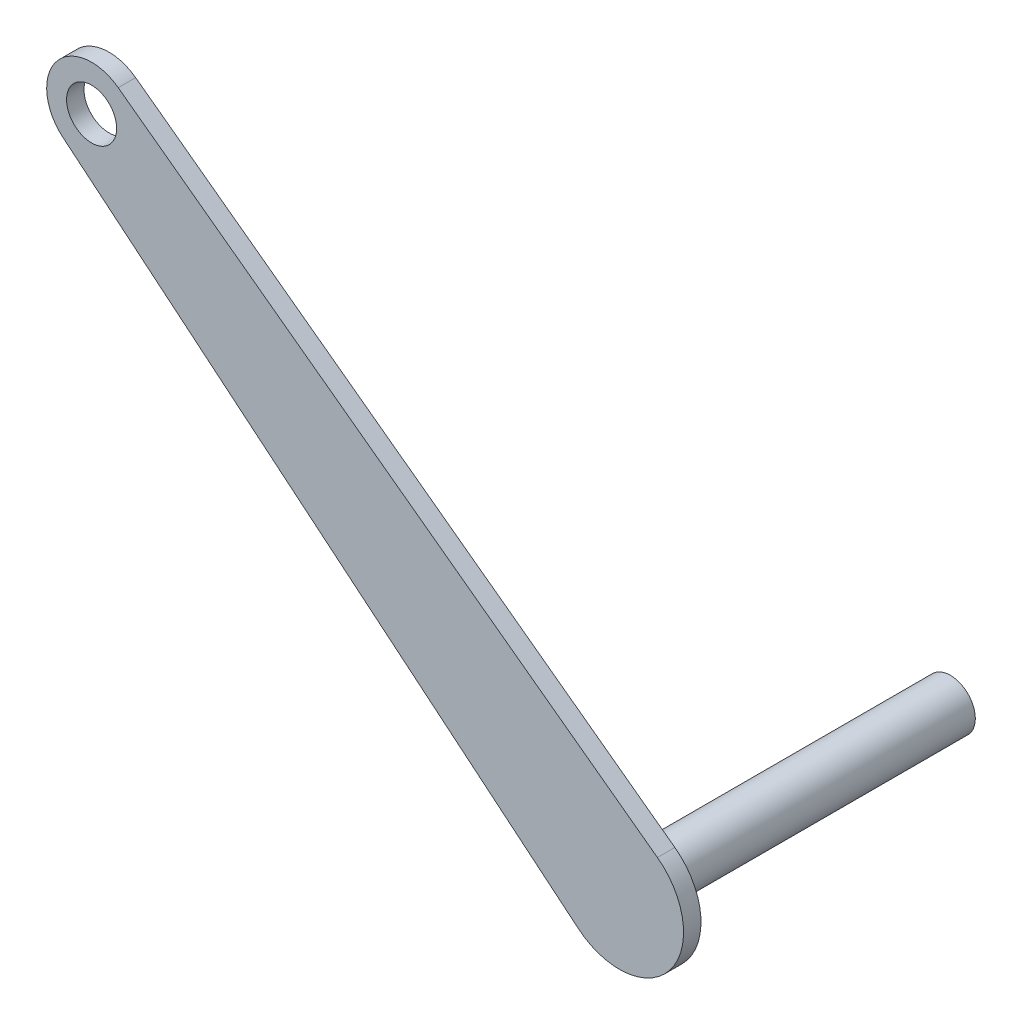
ISO-10303-21;
HEADER;
FILE_DESCRIPTION(('STEP AP214'),'2;1');
FILE_NAME('part.step','',(''),(''),'','','');
FILE_SCHEMA(('AUTOMOTIVE_DESIGN { 1 0 10303 214 1 1 1 1 }'));
ENDSEC;
DATA;
#1=APPLICATION_CONTEXT('core data for automotive mechanical design processes');
#2=APPLICATION_PROTOCOL_DEFINITION('international standard','automotive_design',2000,#1);
#3=PRODUCT_CONTEXT('',#1,'mechanical');
#4=PRODUCT('Part','Part','',(#3));
#5=PRODUCT_RELATED_PRODUCT_CATEGORY('part','',(#4));
#6=PRODUCT_DEFINITION_FORMATION('','',#4);
#7=PRODUCT_DEFINITION_CONTEXT('part definition',#1,'design');
#8=PRODUCT_DEFINITION('design','',#6,#7);
#9=PRODUCT_DEFINITION_SHAPE('','',#8);
#10=(LENGTH_UNIT() NAMED_UNIT(*) SI_UNIT(.MILLI.,.METRE.));
#11=(NAMED_UNIT(*) PLANE_ANGLE_UNIT() SI_UNIT($,.RADIAN.));
#12=(NAMED_UNIT(*) SI_UNIT($,.STERADIAN.) SOLID_ANGLE_UNIT());
#13=UNCERTAINTY_MEASURE_WITH_UNIT(LENGTH_MEASURE(1.E-05),#10,'distance_accuracy_value','');
#14=(GEOMETRIC_REPRESENTATION_CONTEXT(3) GLOBAL_UNCERTAINTY_ASSIGNED_CONTEXT((#13)) GLOBAL_UNIT_ASSIGNED_CONTEXT((#10,
#11,#12)) REPRESENTATION_CONTEXT('',''));
#15=CARTESIAN_POINT('',(0.,0.,0.));
#16=DIRECTION('',(0.,0.,1.));
#17=DIRECTION('',(1.,0.,0.));
#18=AXIS2_PLACEMENT_3D('',#15,#16,#17);
#19=CARTESIAN_POINT('',(-16.5780803786687,54.2991659727017,3.));
#20=DIRECTION('',(0.,0.,1.));
#21=DIRECTION('',(1.,0.,0.));
#22=AXIS2_PLACEMENT_3D('',#19,#20,#21);
#23=PLANE('',#22);
#24=CARTESIAN_POINT('',(-16.5780803786687,54.2991659727017,3.));
#25=DIRECTION('',(0.,0.,1.));
#26=DIRECTION('',(1.,0.,0.));
#27=AXIS2_PLACEMENT_3D('',#24,#25,#26);
#28=CIRCLE('',#27,4.30973614586793);
#29=CARTESIAN_POINT('',(-12.2683442328007,54.2991659727017,3.));
#30=VERTEX_POINT('',#29);
#31=EDGE_CURVE('E98',#30,#30,#28,.T.);
#32=ORIENTED_EDGE('',*,*,#31,.F.);
#33=EDGE_LOOP('',(#32));
#34=FACE_BOUND('',#33,.T.);
#35=CARTESIAN_POINT('',(-16.5780803786687,54.2991659727017,3.));
#36=DIRECTION('',(0.,0.,1.));
#37=DIRECTION('',(1.,0.,0.));
#38=AXIS2_PLACEMENT_3D('',#35,#36,#37);
#39=CIRCLE('',#38,7.73575235674166);
#40=CARTESIAN_POINT('',(-11.9908362627907,60.5280547938461,3.));
#41=VERTEX_POINT('',#40);
#42=CARTESIAN_POINT('',(-21.5162966814582,48.34468158934,3.));
#43=VERTEX_POINT('',#42);
#44=EDGE_CURVE('E109',#41,#43,#39,.T.);
#45=ORIENTED_EDGE('',*,*,#44,.T.);
#46=DIRECTION('',(0.769735651913985,-0.638362770039539,0.));
#47=VECTOR('',#46,1.);
#48=CARTESIAN_POINT('',(-21.5162966814582,48.34468158934,3.));
#49=LINE('',#48,#47);
#50=CARTESIAN_POINT('',(67.2566935657038,-25.2771804329791,3.));
#51=VERTEX_POINT('',#50);
#52=EDGE_CURVE('E93',#43,#51,#49,.T.);
#53=ORIENTED_EDGE('',*,*,#52,.T.);
#54=CARTESIAN_POINT('',(74.3157696242232,-16.765370586239,3.));
#55=DIRECTION('',(0.,0.,1.));
#56=DIRECTION('',(1.,0.,0.));
#57=AXIS2_PLACEMENT_3D('',#54,#55,#56);
#58=CIRCLE('',#57,11.0580948479846);
#59=CARTESIAN_POINT('',(80.8731383435088,-7.8613053828413,3.));
#60=VERTEX_POINT('',#59);
#61=EDGE_CURVE('E59',#51,#60,#58,.T.);
#62=ORIENTED_EDGE('',*,*,#61,.T.);
#63=DIRECTION('',(-0.805207888501749,0.592992627521249,0.));
#64=VECTOR('',#63,1.);
#65=CARTESIAN_POINT('',(80.8731383435088,-7.86130538284129,3.));
#66=LINE('',#65,#64);
#67=EDGE_CURVE('E52',#60,#41,#66,.T.);
#68=ORIENTED_EDGE('',*,*,#67,.T.);
#69=EDGE_LOOP('',(#45,#53,#62,#68));
#70=FACE_BOUND('',#69,.T.);
#71=ADVANCED_FACE('F33',(#34,#70),#23,.T.);
#72=CARTESIAN_POINT('',(-16.5780803786687,54.2991659727017,0.));
#73=DIRECTION('',(0.,0.,1.));
#74=DIRECTION('',(1.,0.,0.));
#75=AXIS2_PLACEMENT_3D('',#72,#73,#74);
#76=PLANE('',#75);
#77=CARTESIAN_POINT('',(-16.5780803786687,54.2991659727017,0.));
#78=DIRECTION('',(0.,0.,1.));
#79=DIRECTION('',(1.,0.,0.));
#80=AXIS2_PLACEMENT_3D('',#77,#78,#79);
#81=CIRCLE('',#80,4.30973614586793);
#82=CARTESIAN_POINT('',(-12.2683442328007,54.2991659727017,0.));
#83=VERTEX_POINT('',#82);
#84=EDGE_CURVE('E102',#83,#83,#81,.T.);
#85=ORIENTED_EDGE('',*,*,#84,.T.);
#86=EDGE_LOOP('',(#85));
#87=FACE_BOUND('',#86,.T.);
#88=CARTESIAN_POINT('',(-16.5780803786687,54.2991659727017,0.));
#89=DIRECTION('',(0.,0.,1.));
#90=DIRECTION('',(1.,0.,0.));
#91=AXIS2_PLACEMENT_3D('',#88,#89,#90);
#92=CIRCLE('',#91,7.73575235674166);
#93=CARTESIAN_POINT('',(-11.9908362627907,60.5280547938461,0.));
#94=VERTEX_POINT('',#93);
#95=CARTESIAN_POINT('',(-21.5162966814582,48.34468158934,0.));
#96=VERTEX_POINT('',#95);
#97=EDGE_CURVE('E85',#94,#96,#92,.T.);
#98=ORIENTED_EDGE('',*,*,#97,.F.);
#99=DIRECTION('',(-0.805207888501749,0.592992627521249,0.));
#100=VECTOR('',#99,1.);
#101=CARTESIAN_POINT('',(80.8731383435088,-7.86130538284129,0.));
#102=LINE('',#101,#100);
#103=CARTESIAN_POINT('',(80.8731383435088,-7.8613053828413,0.));
#104=VERTEX_POINT('',#103);
#105=EDGE_CURVE('E107',#104,#94,#102,.T.);
#106=ORIENTED_EDGE('',*,*,#105,.F.);
#107=CARTESIAN_POINT('',(74.3157696242232,-16.765370586239,0.));
#108=DIRECTION('',(0.,0.,1.));
#109=DIRECTION('',(1.,0.,0.));
#110=AXIS2_PLACEMENT_3D('',#107,#108,#109);
#111=CIRCLE('',#110,11.0580948479846);
#112=CARTESIAN_POINT('',(67.2566935657038,-25.2771804329791,0.));
#113=VERTEX_POINT('',#112);
#114=EDGE_CURVE('E86',#113,#104,#111,.T.);
#115=ORIENTED_EDGE('',*,*,#114,.F.);
#116=DIRECTION('',(0.769735651913985,-0.638362770039539,0.));
#117=VECTOR('',#116,1.);
#118=CARTESIAN_POINT('',(-21.5162966814582,48.34468158934,0.));
#119=LINE('',#118,#117);
#120=EDGE_CURVE('E80',#96,#113,#119,.T.);
#121=ORIENTED_EDGE('',*,*,#120,.F.);
#122=EDGE_LOOP('',(#98,#106,#115,#121));
#123=FACE_BOUND('',#122,.T.);
#124=CARTESIAN_POINT('',(74.3157696242232,-16.765370586239,0.));
#125=DIRECTION('',(0.,0.,1.));
#126=DIRECTION('',(1.,0.,0.));
#127=AXIS2_PLACEMENT_3D('',#124,#125,#126);
#128=CIRCLE('',#127,4.30973614586794);
#129=CARTESIAN_POINT('',(78.6255057700911,-16.765370586239,0.));
#130=VERTEX_POINT('',#129);
#131=EDGE_CURVE('E222',#130,#130,#128,.T.);
#132=ORIENTED_EDGE('',*,*,#131,.T.);
#133=EDGE_LOOP('',(#132));
#134=FACE_BOUND('',#133,.T.);
#135=ADVANCED_FACE('F81',(#87,#123,#134),#76,.F.);
#136=CARTESIAN_POINT('',(-16.5780803786687,54.2991659727017,3.));
#137=DIRECTION('',(0.,0.,-1.));
#138=DIRECTION('',(-1.,0.,0.));
#139=AXIS2_PLACEMENT_3D('',#136,#137,#138);
#140=CYLINDRICAL_SURFACE('',#139,7.73575235674166);
#141=ORIENTED_EDGE('',*,*,#97,.T.);
#142=DIRECTION('',(0.,0.,-1.));
#143=VECTOR('',#142,1.);
#144=CARTESIAN_POINT('',(-21.5162966814582,48.34468158934,3.));
#145=LINE('',#144,#143);
#146=EDGE_CURVE('E11',#43,#96,#145,.T.);
#147=ORIENTED_EDGE('',*,*,#146,.F.);
#148=ORIENTED_EDGE('',*,*,#44,.F.);
#149=DIRECTION('',(0.,0.,-1.));
#150=VECTOR('',#149,1.);
#151=CARTESIAN_POINT('',(-11.9908362627907,60.5280547938461,3.));
#152=LINE('',#151,#150);
#153=EDGE_CURVE('E97',#41,#94,#152,.T.);
#154=ORIENTED_EDGE('',*,*,#153,.T.);
#155=EDGE_LOOP('',(#141,#147,#148,#154));
#156=FACE_BOUND('',#155,.T.);
#157=ADVANCED_FACE('F35',(#156),#140,.T.);
#158=CARTESIAN_POINT('',(-21.5162966814582,48.34468158934,3.));
#159=DIRECTION('',(0.638362770039539,0.769735651913985,0.));
#160=DIRECTION('',(-0.769735651913985,0.638362770039539,0.));
#161=AXIS2_PLACEMENT_3D('',#158,#159,#160);
#162=PLANE('',#161);
#163=ORIENTED_EDGE('',*,*,#120,.T.);
#164=DIRECTION('',(0.,0.,-1.));
#165=VECTOR('',#164,1.);
#166=CARTESIAN_POINT('',(67.2566935657038,-25.2771804329791,3.));
#167=LINE('',#166,#165);
#168=EDGE_CURVE('E41',#51,#113,#167,.T.);
#169=ORIENTED_EDGE('',*,*,#168,.F.);
#170=ORIENTED_EDGE('',*,*,#52,.F.);
#171=ORIENTED_EDGE('',*,*,#146,.T.);
#172=EDGE_LOOP('',(#163,#169,#170,#171));
#173=FACE_BOUND('',#172,.T.);
#174=ADVANCED_FACE('F92',(#173),#162,.F.);
#175=CARTESIAN_POINT('',(74.3157696242232,-16.765370586239,3.));
#176=DIRECTION('',(0.,0.,-1.));
#177=DIRECTION('',(-1.,0.,0.));
#178=AXIS2_PLACEMENT_3D('',#175,#176,#177);
#179=CYLINDRICAL_SURFACE('',#178,11.0580948479846);
#180=ORIENTED_EDGE('',*,*,#114,.T.);
#181=DIRECTION('',(0.,0.,-1.));
#182=VECTOR('',#181,1.);
#183=CARTESIAN_POINT('',(80.8731383435088,-7.8613053828413,3.));
#184=LINE('',#183,#182);
#185=EDGE_CURVE('E116',#60,#104,#184,.T.);
#186=ORIENTED_EDGE('',*,*,#185,.F.);
#187=ORIENTED_EDGE('',*,*,#61,.F.);
#188=ORIENTED_EDGE('',*,*,#168,.T.);
#189=EDGE_LOOP('',(#180,#186,#187,#188));
#190=FACE_BOUND('',#189,.T.);
#191=ADVANCED_FACE('F119',(#190),#179,.T.);
#192=CARTESIAN_POINT('',(80.8731383435088,-7.86130538284129,3.));
#193=DIRECTION('',(-0.592992627521249,-0.805207888501749,0.));
#194=DIRECTION('',(0.805207888501749,-0.592992627521249,0.));
#195=AXIS2_PLACEMENT_3D('',#192,#193,#194);
#196=PLANE('',#195);
#197=ORIENTED_EDGE('',*,*,#105,.T.);
#198=ORIENTED_EDGE('',*,*,#153,.F.);
#199=ORIENTED_EDGE('',*,*,#67,.F.);
#200=ORIENTED_EDGE('',*,*,#185,.T.);
#201=EDGE_LOOP('',(#197,#198,#199,#200));
#202=FACE_BOUND('',#201,.T.);
#203=ADVANCED_FACE('F121',(#202),#196,.F.);
#204=CARTESIAN_POINT('',(-16.5780803786687,54.2991659727017,3.));
#205=DIRECTION('',(0.,0.,-1.));
#206=DIRECTION('',(-1.,0.,0.));
#207=AXIS2_PLACEMENT_3D('',#204,#205,#206);
#208=CYLINDRICAL_SURFACE('',#207,4.30973614586793);
#209=ORIENTED_EDGE('',*,*,#31,.T.);
#210=EDGE_LOOP('',(#209));
#211=FACE_BOUND('',#210,.T.);
#212=ORIENTED_EDGE('',*,*,#84,.F.);
#213=EDGE_LOOP('',(#212));
#214=FACE_BOUND('',#213,.T.);
#215=ADVANCED_FACE('F135',(#211,#214),#208,.F.);
#216=CARTESIAN_POINT('',(74.3157696242232,-16.765370586239,-54.));
#217=DIRECTION('',(0.,0.,1.));
#218=DIRECTION('',(1.,0.,0.));
#219=AXIS2_PLACEMENT_3D('',#216,#217,#218);
#220=CYLINDRICAL_SURFACE('',#219,4.30973614586794);
#221=CARTESIAN_POINT('',(74.3157696242232,-16.765370586239,-54.));
#222=DIRECTION('',(0.,0.,1.));
#223=DIRECTION('',(1.,0.,0.));
#224=AXIS2_PLACEMENT_3D('',#221,#222,#223);
#225=CIRCLE('',#224,4.30973614586794);
#226=CARTESIAN_POINT('',(78.6255057700911,-16.765370586239,-54.));
#227=VERTEX_POINT('',#226);
#228=EDGE_CURVE('E221',#227,#227,#225,.T.);
#229=ORIENTED_EDGE('',*,*,#228,.T.);
#230=EDGE_LOOP('',(#229));
#231=FACE_BOUND('',#230,.T.);
#232=ORIENTED_EDGE('',*,*,#131,.F.);
#233=EDGE_LOOP('',(#232));
#234=FACE_BOUND('',#233,.T.);
#235=ADVANCED_FACE('F158',(#231,#234),#220,.T.);
#236=CARTESIAN_POINT('',(74.3157696242232,-16.765370586239,-54.));
#237=DIRECTION('',(0.,0.,1.));
#238=DIRECTION('',(1.,0.,0.));
#239=AXIS2_PLACEMENT_3D('',#236,#237,#238);
#240=PLANE('',#239);
#241=ORIENTED_EDGE('',*,*,#228,.F.);
#242=EDGE_LOOP('',(#241));
#243=FACE_BOUND('',#242,.T.);
#244=ADVANCED_FACE('F168',(#243),#240,.F.);
#245=CLOSED_SHELL('',(#71,#135,#157,#174,#191,#203,#215,#235,#244));
#246=MANIFOLD_SOLID_BREP('B2',#245);
#247=ADVANCED_BREP_SHAPE_REPRESENTATION('',(#18,#246),#14);
#248=SHAPE_DEFINITION_REPRESENTATION(#9,#247);
ENDSEC;
END-ISO-10303-21;
